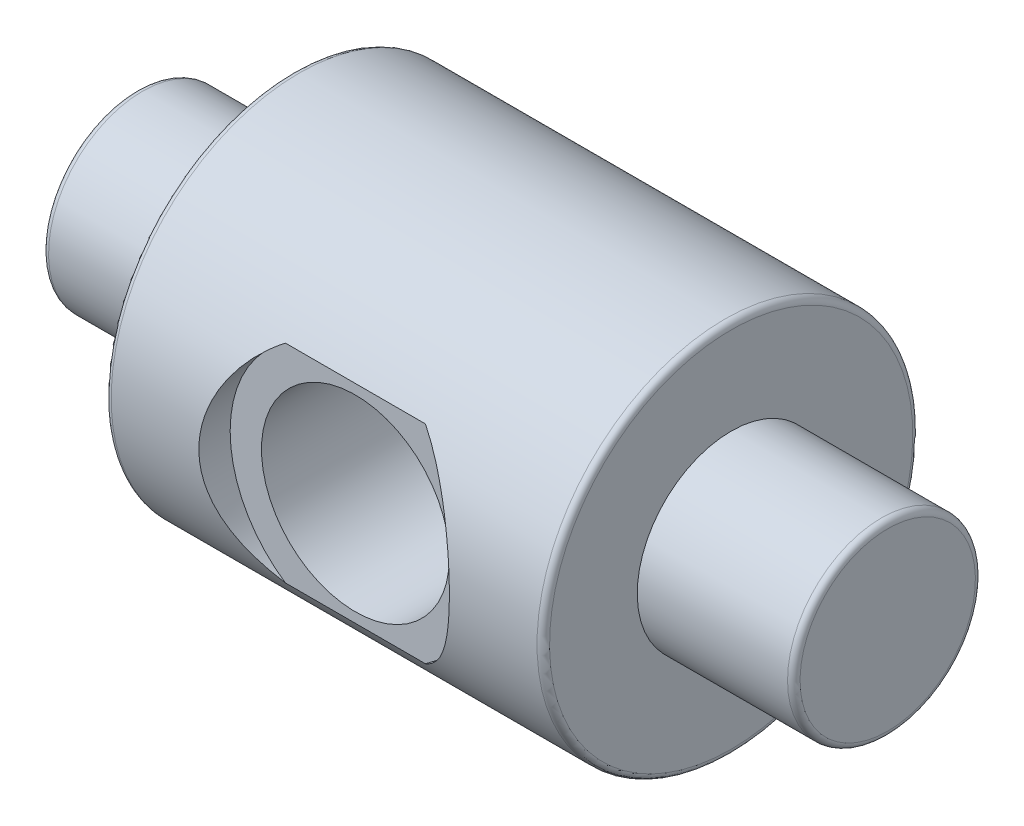
ISO-10303-21;
HEADER;
FILE_DESCRIPTION(('STEP AP214'),'2;1');
FILE_NAME('part.step','',(''),(''),'','','');
FILE_SCHEMA(('AUTOMOTIVE_DESIGN { 1 0 10303 214 1 1 1 1 }'));
ENDSEC;
DATA;
#1=APPLICATION_CONTEXT('core data for automotive mechanical design processes');
#2=APPLICATION_PROTOCOL_DEFINITION('international standard','automotive_design',2000,#1);
#3=PRODUCT_CONTEXT('',#1,'mechanical');
#4=PRODUCT('Part','Part','',(#3));
#5=PRODUCT_RELATED_PRODUCT_CATEGORY('part','',(#4));
#6=PRODUCT_DEFINITION_FORMATION('','',#4);
#7=PRODUCT_DEFINITION_CONTEXT('part definition',#1,'design');
#8=PRODUCT_DEFINITION('design','',#6,#7);
#9=PRODUCT_DEFINITION_SHAPE('','',#8);
#10=(LENGTH_UNIT() NAMED_UNIT(*) SI_UNIT(.MILLI.,.METRE.));
#11=(NAMED_UNIT(*) PLANE_ANGLE_UNIT() SI_UNIT($,.RADIAN.));
#12=(NAMED_UNIT(*) SI_UNIT($,.STERADIAN.) SOLID_ANGLE_UNIT());
#13=UNCERTAINTY_MEASURE_WITH_UNIT(LENGTH_MEASURE(1.E-05),#10,'distance_accuracy_value','');
#14=(GEOMETRIC_REPRESENTATION_CONTEXT(3) GLOBAL_UNCERTAINTY_ASSIGNED_CONTEXT((#13)) GLOBAL_UNIT_ASSIGNED_CONTEXT((#10,
#11,#12)) REPRESENTATION_CONTEXT('',''));
#15=CARTESIAN_POINT('',(0.,0.,0.));
#16=DIRECTION('',(0.,0.,1.));
#17=DIRECTION('',(1.,0.,0.));
#18=AXIS2_PLACEMENT_3D('',#15,#16,#17);
#19=CARTESIAN_POINT('',(7.94580419580419,-1.5,0.));
#20=DIRECTION('',(-1.,0.,0.));
#21=DIRECTION('',(0.,-1.,0.));
#22=AXIS2_PLACEMENT_3D('',#19,#20,#21);
#23=PLANE('',#22);
#24=CARTESIAN_POINT('',(7.94580419580419,0.,0.));
#25=DIRECTION('',(-1.,0.,0.));
#26=DIRECTION('',(0.,-1.,0.));
#27=AXIS2_PLACEMENT_3D('',#24,#25,#26);
#28=CIRCLE('',#27,1.4);
#29=CARTESIAN_POINT('',(7.94580419580419,-1.4,0.));
#30=VERTEX_POINT('',#29);
#31=EDGE_CURVE('E191',#30,#30,#28,.F.);
#32=ORIENTED_EDGE('',*,*,#31,.T.);
#33=EDGE_LOOP('',(#32));
#34=FACE_BOUND('',#33,.T.);
#35=ADVANCED_FACE('F41',(#34),#23,.F.);
#36=CARTESIAN_POINT('',(-4.05419580419581,0.,0.));
#37=DIRECTION('',(1.,0.,0.));
#38=DIRECTION('',(0.,1.,0.));
#39=AXIS2_PLACEMENT_3D('',#36,#37,#38);
#40=PLANE('',#39);
#41=CARTESIAN_POINT('',(-4.05419580419581,0.,0.));
#42=DIRECTION('',(1.,0.,0.));
#43=DIRECTION('',(0.,1.,0.));
#44=AXIS2_PLACEMENT_3D('',#41,#42,#43);
#45=CIRCLE('',#44,1.4);
#46=CARTESIAN_POINT('',(-4.05419580419581,1.4,0.));
#47=VERTEX_POINT('',#46);
#48=EDGE_CURVE('E88',#47,#47,#45,.F.);
#49=ORIENTED_EDGE('',*,*,#48,.T.);
#50=EDGE_LOOP('',(#49));
#51=FACE_BOUND('',#50,.T.);
#52=ADVANCED_FACE('F126',(#51),#40,.F.);
#53=CARTESIAN_POINT('',(7.94580419580419,0.,0.));
#54=DIRECTION('',(1.,0.,0.));
#55=DIRECTION('',(0.,1.,0.));
#56=AXIS2_PLACEMENT_3D('',#53,#54,#55);
#57=CYLINDRICAL_SURFACE('',#56,1.5);
#58=CARTESIAN_POINT('',(-3.95419580419581,0.,0.));
#59=DIRECTION('',(1.,0.,0.));
#60=DIRECTION('',(0.,1.,0.));
#61=AXIS2_PLACEMENT_3D('',#58,#59,#60);
#62=CIRCLE('',#61,1.5);
#63=CARTESIAN_POINT('',(-3.95419580419581,1.5,0.));
#64=VERTEX_POINT('',#63);
#65=EDGE_CURVE('E175',#64,#64,#62,.T.);
#66=ORIENTED_EDGE('',*,*,#65,.T.);
#67=EDGE_LOOP('',(#66));
#68=FACE_BOUND('',#67,.T.);
#69=CARTESIAN_POINT('',(-1.55419580419581,0.,0.));
#70=DIRECTION('',(1.,0.,0.));
#71=DIRECTION('',(0.,1.,0.));
#72=AXIS2_PLACEMENT_3D('',#69,#70,#71);
#73=CIRCLE('',#72,1.5);
#74=CARTESIAN_POINT('',(-1.55419580419581,1.5,0.));
#75=VERTEX_POINT('',#74);
#76=EDGE_CURVE('E188',#75,#75,#73,.T.);
#77=ORIENTED_EDGE('',*,*,#76,.F.);
#78=EDGE_LOOP('',(#77));
#79=FACE_BOUND('',#78,.T.);
#80=ADVANCED_FACE('F132',(#68,#79),#57,.T.);
#81=CARTESIAN_POINT('',(-1.55419580419581,-1.5,0.));
#82=DIRECTION('',(1.,0.,0.));
#83=DIRECTION('',(0.,1.,0.));
#84=AXIS2_PLACEMENT_3D('',#81,#82,#83);
#85=PLANE('',#84);
#86=CARTESIAN_POINT('',(-1.55419580419581,0.,0.));
#87=DIRECTION('',(1.,0.,0.));
#88=DIRECTION('',(0.,1.,0.));
#89=AXIS2_PLACEMENT_3D('',#86,#87,#88);
#90=CIRCLE('',#89,2.9);
#91=CARTESIAN_POINT('',(-1.55419580419581,2.9,0.));
#92=VERTEX_POINT('',#91);
#93=EDGE_CURVE('E154',#92,#92,#90,.F.);
#94=ORIENTED_EDGE('',*,*,#93,.T.);
#95=EDGE_LOOP('',(#94));
#96=FACE_BOUND('',#95,.T.);
#97=ORIENTED_EDGE('',*,*,#76,.T.);
#98=EDGE_LOOP('',(#97));
#99=FACE_BOUND('',#98,.T.);
#100=ADVANCED_FACE('F121',(#96,#99),#85,.F.);
#101=CARTESIAN_POINT('',(7.94580419580419,0.,0.));
#102=DIRECTION('',(1.,0.,0.));
#103=DIRECTION('',(0.,1.,0.));
#104=AXIS2_PLACEMENT_3D('',#101,#102,#103);
#105=CYLINDRICAL_SURFACE('',#104,3.);
#106=CARTESIAN_POINT('',(3.44580419580419,0.,-3.));
#107=CARTESIAN_POINT('',(3.44579924232841,-0.0788579444268502,-2.99999570107562));
#108=CARTESIAN_POINT('',(3.43954908612261,-0.157809899546344,-2.99685736529635));
#109=CARTESIAN_POINT('',(3.41482487529189,-0.313380352903344,-2.98461234055736));
#110=CARTESIAN_POINT('',(3.39632760630747,-0.389994130070444,-2.97549431743379));
#111=CARTESIAN_POINT('',(3.34801348287925,-0.538400317320674,-2.95224419105063));
#112=CARTESIAN_POINT('',(3.31824061943224,-0.61021020440872,-2.93813158766306));
#113=CARTESIAN_POINT('',(3.24844826375672,-0.747708925209898,-2.90618664773642));
#114=CARTESIAN_POINT('',(3.2084295794309,-0.813398240985089,-2.88835460450288));
#115=CARTESIAN_POINT('',(3.11652832157626,-0.941261726642864,-2.84934387387093));
#116=CARTESIAN_POINT('',(3.06407447694474,-1.00298281668316,-2.82802798691306));
#117=CARTESIAN_POINT('',(2.95002197693364,-1.11716916730047,-2.78489955370115));
#118=CARTESIAN_POINT('',(2.88841641814553,-1.16962737466015,-2.76308664313552));
#119=CARTESIAN_POINT('',(2.75207917151912,-1.26787800067542,-2.71948426796021));
#120=CARTESIAN_POINT('',(2.67670004828532,-1.31283800332746,-2.69782780455198));
#121=CARTESIAN_POINT('',(2.51825319182487,-1.38925234033604,-2.65928968158481));
#122=CARTESIAN_POINT('',(2.43519100272007,-1.4207163224495,-2.64240461410484));
#123=CARTESIAN_POINT('',(2.26880653767131,-1.46719866328288,-2.61686800556713));
#124=CARTESIAN_POINT('',(2.1857975177031,-1.48308878562066,-2.6077840737557));
#125=CARTESIAN_POINT('',(2.01783593913498,-1.50064048996327,-2.59772834922792));
#126=CARTESIAN_POINT('',(1.93288538449746,-1.50231613255961,-2.59674854014932));
#127=CARTESIAN_POINT('',(1.77437515933114,-1.49203093075844,-2.60266395385873));
#128=CARTESIAN_POINT('',(1.70066814896962,-1.48167683930523,-2.6086314549302));
#129=CARTESIAN_POINT('',(1.55622133174463,-1.4504097735854,-2.62614343100775));
#130=CARTESIAN_POINT('',(1.48548247784622,-1.42949343584648,-2.63768968247664));
#131=CARTESIAN_POINT('',(1.3469604969557,-1.37731467057901,-2.66531214619112));
#132=CARTESIAN_POINT('',(1.27928459762551,-1.34582260067399,-2.68148760995998));
#133=CARTESIAN_POINT('',(1.14985275691918,-1.273562531502,-2.71655106422106));
#134=CARTESIAN_POINT('',(1.08809949240406,-1.2327903657187,-2.73544027170286));
#135=CARTESIAN_POINT('',(0.964022316689354,-1.13709908236918,-2.77669736854929));
#136=CARTESIAN_POINT('',(0.902618885439958,-1.08104168755392,-2.79920265355119));
#137=CARTESIAN_POINT('',(0.789701067917841,-0.95933336811206,-2.84321434950611));
#138=CARTESIAN_POINT('',(0.738191407753369,-0.893677884861429,-2.86472027938201));
#139=CARTESIAN_POINT('',(0.644275704259602,-0.750774758747773,-2.90552980924446));
#140=CARTESIAN_POINT('',(0.602403487135583,-0.673130387399114,-2.92468476243011));
#141=CARTESIAN_POINT('',(0.53265865223968,-0.510699323233196,-2.95736821681863));
#142=CARTESIAN_POINT('',(0.504774918281444,-0.425918364397914,-2.9709011841533));
#143=CARTESIAN_POINT('',(0.466091090229179,-0.259149737491054,-2.98986500612153));
#144=CARTESIAN_POINT('',(0.454067342184021,-0.17751229582249,-2.99587407451965));
#145=CARTESIAN_POINT('',(0.443607099102462,-0.0131693999240281,-3.00109520188655));
#146=CARTESIAN_POINT('',(0.445164167344991,0.0695355298048624,-3.00031048081978));
#147=CARTESIAN_POINT('',(0.461114228432308,0.22684945797898,-2.99236788380152));
#148=CARTESIAN_POINT('',(0.474502994899184,0.301589112074894,-2.98570868532252));
#149=CARTESIAN_POINT('',(0.512161303646875,0.447610338452911,-2.9673325697226));
#150=CARTESIAN_POINT('',(0.536432045484434,0.51889152853663,-2.95561509501618));
#151=CARTESIAN_POINT('',(0.595801895453743,0.658332912674359,-2.92776377120382));
#152=CARTESIAN_POINT('',(0.631190770978624,0.726345595508705,-2.91151322654446));
#153=CARTESIAN_POINT('',(0.711465499274044,0.855692042548907,-2.87615961476126));
#154=CARTESIAN_POINT('',(0.756355397697286,0.917022944664887,-2.85705533350407));
#155=CARTESIAN_POINT('',(0.859444833800268,1.03765153393382,-2.81562332004297));
#156=CARTESIAN_POINT('',(0.918518498471914,1.09615811672854,-2.79316327265249));
#157=CARTESIAN_POINT('',(1.04569192272078,1.20278448167828,-2.7489358741323));
#158=CARTESIAN_POINT('',(1.11379787407607,1.25089707856781,-2.72716901100071));
#159=CARTESIAN_POINT('',(1.26126967706366,1.33756187171853,-2.68576788309734));
#160=CARTESIAN_POINT('',(1.34102109494591,1.37553824370037,-2.66628794383591));
#161=CARTESIAN_POINT('',(1.50706929716664,1.43712423890206,-2.63361108441202));
#162=CARTESIAN_POINT('',(1.59335748550453,1.46075237380052,-2.62040607332625));
#163=CARTESIAN_POINT('',(1.76116953013125,1.49079253120031,-2.60342251538703));
#164=CARTESIAN_POINT('',(1.84235557595706,1.49863949460818,-2.59886075197597));
#165=CARTESIAN_POINT('',(2.00497479655098,1.5010337315643,-2.59748031962405));
#166=CARTESIAN_POINT('',(2.08640784891099,1.49558676993486,-2.60065829439585));
#167=CARTESIAN_POINT('',(2.23902944810435,1.47288918838996,-2.61356793076615));
#168=CARTESIAN_POINT('',(2.3104549010213,1.45681247151455,-2.62264641723988));
#169=CARTESIAN_POINT('',(2.44951637494074,1.41476303733662,-2.64556524281479));
#170=CARTESIAN_POINT('',(2.51715116894224,1.38878713673988,-2.65940711354503));
#171=CARTESIAN_POINT('',(2.651741472284,1.32572361795085,-2.69142795546803));
#172=CARTESIAN_POINT('',(2.71834604854774,1.28800670672355,-2.70983583593881));
#173=CARTESIAN_POINT('',(2.84471600007608,1.20322645745609,-2.74852997452291));
#174=CARTESIAN_POINT('',(2.90447779158586,1.15615825686234,-2.76881720693416));
#175=CARTESIAN_POINT('',(3.02301716933621,1.04730498999206,-2.81193484737138));
#176=CARTESIAN_POINT('',(3.08079284932963,0.984426634495892,-2.83477474959942));
#177=CARTESIAN_POINT('',(3.1851986709571,0.849232209349796,-2.87816628389896));
#178=CARTESIAN_POINT('',(3.23182280500905,0.776911084957796,-2.89871667939293));
#179=CARTESIAN_POINT('',(3.3126587398723,0.623897395174419,-2.93547014349806));
#180=CARTESIAN_POINT('',(3.3467804496589,0.543149255665096,-2.95164144740899));
#181=CARTESIAN_POINT('',(3.40051644744031,0.37611315170713,-2.9775201194848));
#182=CARTESIAN_POINT('',(3.42017196601276,0.28984169938365,-2.98724585044602));
#183=CARTESIAN_POINT('',(3.43665031243281,0.168902919736343,-2.99543192870217));
#184=CARTESIAN_POINT('',(3.4400781571037,0.135242819162348,-2.99714048010376));
#185=CARTESIAN_POINT('',(3.44465619407532,0.0677275977076381,-2.99942545465223));
#186=CARTESIAN_POINT('',(3.44580632350951,0.033872471469943,-3.00000184655071));
#187=CARTESIAN_POINT('',(3.44580419580419,0.,-3.));
#188=B_SPLINE_CURVE_WITH_KNOTS('',3,(#106,#107,#108,#109,#110,#111,#112,#113,#114,#115,#116,
#117,#118,#119,#120,#121,#122,#123,#124,#125,#126,#127,#128,#129,#130,#131,#132,#133,#134,#135,
#136,#137,#138,#139,#140,#141,#142,#143,#144,#145,#146,#147,#148,#149,#150,#151,#152,#153,#154,
#155,#156,#157,#158,#159,#160,#161,#162,#163,#164,#165,#166,#167,#168,#169,#170,#171,#172,#173,
#174,#175,#176,#177,#178,#179,#180,#181,#182,#183,#184,#185,#186,#187),.UNSPECIFIED.,.T.,.F.,(4,
2,2,2,2,2,2,2,2,2,2,2,2,2,2,2,2,2,2,2,2,2,2,2,2,2,2,2,2,2,2,2,2,2,2,2,2,2,2,2,4),(0.,
0.236436386130439,0.473322224563797,0.709293233238448,0.945245640872352,1.19547263807713,
1.44588935648105,1.71572589646129,1.98536921847421,2.23887018210344,2.49212035993531,
2.71508568613981,2.93812205888518,3.16635360252731,3.39468781890333,3.65197412000818,
3.90938301898029,4.17874533321661,4.44789325368419,4.69474935707018,4.94148846767214,
5.16910359759183,5.39674382446397,5.63089284041848,5.86514176122509,6.12239415966628,
6.37982382923148,6.64972023242589,6.91926767918176,7.1629396125457,7.40650589797018,
7.62686895373284,7.84730293182527,8.08254685170431,8.31791341715446,8.58187864135757,
8.84598575071869,9.1119602049529,9.37717362931724,9.47872920200875,9.58028757766599),.UNSPECIFIED.);
#189=CARTESIAN_POINT('',(3.44580419580419,0.,-3.));
#190=VERTEX_POINT('',#189);
#191=EDGE_CURVE('E213',#190,#190,#188,.T.);
#192=ORIENTED_EDGE('',*,*,#191,.F.);
#193=EDGE_LOOP('',(#192));
#194=FACE_BOUND('',#193,.T.);
#195=DIRECTION('',(1.,0.,0.));
#196=VECTOR('',#195,1.);
#197=CARTESIAN_POINT('',(7.94580419580419,-1.6583123951777,2.5));
#198=LINE('',#197,#196);
#199=CARTESIAN_POINT('',(0.827770207054297,-1.6583123951777,2.5));
#200=VERTEX_POINT('',#199);
#201=CARTESIAN_POINT('',(3.06383818455409,-1.6583123951777,2.5));
#202=VERTEX_POINT('',#201);
#203=EDGE_CURVE('E11',#200,#202,#198,.T.);
#204=ORIENTED_EDGE('',*,*,#203,.F.);
#205=CARTESIAN_POINT('',(0.827770207054297,-1.6583123951777,2.5));
#206=CARTESIAN_POINT('',(0.779685945316833,-1.62588041682893,2.52151479876285));
#207=CARTESIAN_POINT('',(0.733152584594997,-1.59147775995563,2.54342347636609));
#208=CARTESIAN_POINT('',(0.643288747881532,-1.51881718972826,2.5874697531549));
#209=CARTESIAN_POINT('',(0.599959256821425,-1.48055809930372,2.60960742037181));
#210=CARTESIAN_POINT('',(0.474370998134739,-1.35957897250648,2.67582114663101));
#211=CARTESIAN_POINT('',(0.397208935398831,-1.27112677213643,2.71937159504119));
#212=CARTESIAN_POINT('',(0.258333778056647,-1.0800174283792,2.80078430015006));
#213=CARTESIAN_POINT('',(0.196668052805781,-0.977318184431939,2.83862897767655));
#214=CARTESIAN_POINT('',(0.0920064420860454,-0.760170773384892,2.90429124381123));
#215=CARTESIAN_POINT('',(0.0489438146591888,-0.645766459364152,2.93214461594087));
#216=CARTESIAN_POINT('',(-0.0120857428518818,-0.422457298896366,2.97201413865436));
#217=CARTESIAN_POINT('',(-0.0323857129055941,-0.314455876194931,2.98549347454722));
#218=CARTESIAN_POINT('',(-0.0549185653556693,-0.0957318708440023,3.00046894125686));
#219=CARTESIAN_POINT('',(-0.0571581058479313,0.0149896939065711,3.00196948813078));
#220=CARTESIAN_POINT('',(-0.0443642776334021,0.219788899237262,2.99345292695804));
#221=CARTESIAN_POINT('',(-0.0316315152469733,0.314087916632495,2.98496974119453));
#222=CARTESIAN_POINT('',(0.0067156534721659,0.498831374402186,2.95970537418975));
#223=CARTESIAN_POINT('',(0.0323281037416411,0.589276397828328,2.94292545299631));
#224=CARTESIAN_POINT('',(0.0958871927934474,0.766037685544142,2.90199776264025));
#225=CARTESIAN_POINT('',(0.134070351168904,0.852235141290292,2.87770930064207));
#226=CARTESIAN_POINT('',(0.221244871959259,1.01715798189846,2.8236387306717));
#227=CARTESIAN_POINT('',(0.270247158057769,1.09587569901239,2.79385107537833));
#228=CARTESIAN_POINT('',(0.385548338380811,1.25565427239455,2.72615287516341));
#229=CARTESIAN_POINT('',(0.453323179510542,1.33541158103129,2.6876905104863));
#230=CARTESIAN_POINT('',(0.599836191729014,1.48295801527083,2.60917581519461));
#231=CARTESIAN_POINT('',(0.67855685828405,1.55076586541565,2.56912609477701));
#232=CARTESIAN_POINT('',(0.783762675861827,1.62799531219029,2.51991822969558));
#233=CARTESIAN_POINT('',(0.805606913338656,1.64336841165434,2.5099145043454));
#234=CARTESIAN_POINT('',(0.827770207054296,1.6583123951777,2.5));
#235=B_SPLINE_CURVE_WITH_KNOTS('',3,(#205,#206,#207,#208,#209,#210,#211,#212,#213,#214,#215,
#216,#217,#218,#219,#220,#221,#222,#223,#224,#225,#226,#227,#228,#229,#230,#231,#232,#233,#234),
.UNSPECIFIED.,.F.,.F.,(4,2,2,2,2,2,2,2,2,2,2,2,2,2,4),(0.,0.185463815245249,0.370984410633051,
0.744697847347587,1.1195401269487,1.49302619268151,1.82315350216072,2.1531591024743,
2.43842427846838,2.72364614376402,3.01457448418865,3.30579791879389,3.6390815214847,
3.97183814013364,4.05738621739483),.UNSPECIFIED.);
#236=CARTESIAN_POINT('',(0.827770207054297,1.6583123951777,2.5));
#237=VERTEX_POINT('',#236);
#238=EDGE_CURVE('E75',#200,#237,#235,.T.);
#239=ORIENTED_EDGE('',*,*,#238,.T.);
#240=DIRECTION('',(1.,0.,0.));
#241=VECTOR('',#240,1.);
#242=CARTESIAN_POINT('',(7.94580419580419,1.6583123951777,2.5));
#243=LINE('',#242,#241);
#244=CARTESIAN_POINT('',(3.06383818455409,1.6583123951777,2.5));
#245=VERTEX_POINT('',#244);
#246=EDGE_CURVE('E50',#245,#237,#243,.F.);
#247=ORIENTED_EDGE('',*,*,#246,.F.);
#248=CARTESIAN_POINT('',(3.06383818455409,1.6583123951777,2.5));
#249=CARTESIAN_POINT('',(3.11191178235131,1.6258873642231,2.52151001312796));
#250=CARTESIAN_POINT('',(3.15843510549844,1.59149294579639,2.54341372114114));
#251=CARTESIAN_POINT('',(3.24828089960978,1.51885007427147,2.58745036830228));
#252=CARTESIAN_POINT('',(3.29160234535144,1.48060039592844,2.60958337830715));
#253=CARTESIAN_POINT('',(3.41720432832784,1.35961640589293,2.67580244791161));
#254=CARTESIAN_POINT('',(3.49438486707682,1.27114452414492,2.71936294341682));
#255=CARTESIAN_POINT('',(3.63330567783501,1.07997701210369,2.80080261031528));
#256=CARTESIAN_POINT('',(3.69499483340098,0.977235986077269,2.83866281226665));
#257=CARTESIAN_POINT('',(3.79964233627908,0.760056300306222,2.90431693687234));
#258=CARTESIAN_POINT('',(3.84268402034553,0.645672566937875,2.93215555020667));
#259=CARTESIAN_POINT('',(3.89828577989016,0.442262965807034,2.96848222513164));
#260=CARTESIAN_POINT('',(3.91602259651958,0.355206388867216,2.98021552307509));
#261=CARTESIAN_POINT('',(3.93978389025567,0.178772504833101,2.99597611850312));
#262=CARTESIAN_POINT('',(3.94580628592278,0.0893947881728608,3.00000204652624));
#263=CARTESIAN_POINT('',(3.94580184662937,-0.100474675054874,2.9999976998205));
#264=CARTESIAN_POINT('',(3.93818907429411,-0.200970915673955,2.99490706648021));
#265=CARTESIAN_POINT('',(3.90820691112413,-0.398741600010064,2.97504644392662));
#266=CARTESIAN_POINT('',(3.88583128517415,-0.496014664174523,2.96027236491161));
#267=CARTESIAN_POINT('',(3.82770515128703,-0.684182849018027,2.92251047554535));
#268=CARTESIAN_POINT('',(3.7920210054226,-0.775107000935844,2.89956344422965));
#269=CARTESIAN_POINT('',(3.70876937362634,-0.949365498586441,2.84727869888586));
#270=CARTESIAN_POINT('',(3.6611929941124,-1.03269410006907,2.81793620413586));
#271=CARTESIAN_POINT('',(3.55107512941529,-1.19739254671204,2.75223145355421));
#272=CARTESIAN_POINT('',(3.4875990520034,-1.2779789171133,2.71548267020019));
#273=CARTESIAN_POINT('',(3.34987715029411,-1.42791517388998,2.63971454495952));
#274=CARTESIAN_POINT('',(3.27564348652293,-1.49727756307281,2.60069779624674));
#275=CARTESIAN_POINT('',(3.1536939004277,-1.59499101398225,2.54118872231492));
#276=CARTESIAN_POINT('',(3.10944255257411,-1.62755479088594,2.52041236005112));
#277=CARTESIAN_POINT('',(3.06383818455437,-1.65831239517809,2.50000000000007));
#278=B_SPLINE_CURVE_WITH_KNOTS('',3,(#248,#249,#250,#251,#252,#253,#254,#255,#256,#257,#258,
#259,#260,#261,#262,#263,#264,#265,#266,#267,#268,#269,#270,#271,#272,#273,#274,#275,#276,#277),
.UNSPECIFIED.,.F.,.F.,(4,2,2,2,2,2,2,2,2,2,2,2,2,2,4),(0.,0.18542255262513,0.370904221550316,
0.744697636055784,1.11970870108441,1.49302608142482,1.76083995125021,2.02870140238451,
2.32976249120777,2.63095081513879,2.93065693760602,3.23058786878475,3.55628934735127,
3.88162547955982,4.05765893947298),.UNSPECIFIED.);
#279=EDGE_CURVE('E56',#245,#202,#278,.T.);
#280=ORIENTED_EDGE('',*,*,#279,.T.);
#281=EDGE_LOOP('',(#204,#239,#247,#280));
#282=FACE_BOUND('',#281,.T.);
#283=CARTESIAN_POINT('',(5.34580419580419,0.,0.));
#284=DIRECTION('',(-1.,0.,0.));
#285=DIRECTION('',(0.,-1.,0.));
#286=AXIS2_PLACEMENT_3D('',#283,#284,#285);
#287=CIRCLE('',#286,3.);
#288=CARTESIAN_POINT('',(5.34580419580419,-3.,0.));
#289=VERTEX_POINT('',#288);
#290=EDGE_CURVE('E160',#289,#289,#287,.T.);
#291=ORIENTED_EDGE('',*,*,#290,.T.);
#292=EDGE_LOOP('',(#291));
#293=FACE_BOUND('',#292,.T.);
#294=CARTESIAN_POINT('',(-1.45419580419581,0.,0.));
#295=DIRECTION('',(1.,0.,0.));
#296=DIRECTION('',(0.,1.,0.));
#297=AXIS2_PLACEMENT_3D('',#294,#295,#296);
#298=CIRCLE('',#297,3.);
#299=CARTESIAN_POINT('',(-1.45419580419581,3.,0.));
#300=VERTEX_POINT('',#299);
#301=EDGE_CURVE('E157',#300,#300,#298,.T.);
#302=ORIENTED_EDGE('',*,*,#301,.T.);
#303=EDGE_LOOP('',(#302));
#304=FACE_BOUND('',#303,.T.);
#305=ADVANCED_FACE('F81',(#194,#282,#293,#304),#105,.T.);
#306=CARTESIAN_POINT('',(5.44580419580419,-3.,0.));
#307=DIRECTION('',(-1.,0.,0.));
#308=DIRECTION('',(0.,-1.,0.));
#309=AXIS2_PLACEMENT_3D('',#306,#307,#308);
#310=PLANE('',#309);
#311=CARTESIAN_POINT('',(5.44580419580419,0.,0.));
#312=DIRECTION('',(-1.,0.,0.));
#313=DIRECTION('',(0.,-1.,0.));
#314=AXIS2_PLACEMENT_3D('',#311,#312,#313);
#315=CIRCLE('',#314,2.9);
#316=CARTESIAN_POINT('',(5.44580419580419,-2.9,0.));
#317=VERTEX_POINT('',#316);
#318=EDGE_CURVE('E161',#317,#317,#315,.F.);
#319=ORIENTED_EDGE('',*,*,#318,.T.);
#320=EDGE_LOOP('',(#319));
#321=FACE_BOUND('',#320,.T.);
#322=CARTESIAN_POINT('',(5.44580419580419,0.,0.));
#323=DIRECTION('',(1.,0.,0.));
#324=DIRECTION('',(0.,1.,0.));
#325=AXIS2_PLACEMENT_3D('',#322,#323,#324);
#326=CIRCLE('',#325,1.5);
#327=CARTESIAN_POINT('',(5.44580419580419,1.5,0.));
#328=VERTEX_POINT('',#327);
#329=EDGE_CURVE('E79',#328,#328,#326,.T.);
#330=ORIENTED_EDGE('',*,*,#329,.F.);
#331=EDGE_LOOP('',(#330));
#332=FACE_BOUND('',#331,.T.);
#333=ADVANCED_FACE('F114',(#321,#332),#310,.F.);
#334=CARTESIAN_POINT('',(7.94580419580419,0.,0.));
#335=DIRECTION('',(1.,0.,0.));
#336=DIRECTION('',(0.,1.,0.));
#337=AXIS2_PLACEMENT_3D('',#334,#335,#336);
#338=CYLINDRICAL_SURFACE('',#337,1.5);
#339=CARTESIAN_POINT('',(7.8458041958042,0.,0.));
#340=DIRECTION('',(-1.,0.,0.));
#341=DIRECTION('',(0.,-1.,0.));
#342=AXIS2_PLACEMENT_3D('',#339,#340,#341);
#343=CIRCLE('',#342,1.5);
#344=CARTESIAN_POINT('',(7.8458041958042,-1.5,0.));
#345=VERTEX_POINT('',#344);
#346=EDGE_CURVE('E170',#345,#345,#343,.T.);
#347=ORIENTED_EDGE('',*,*,#346,.T.);
#348=EDGE_LOOP('',(#347));
#349=FACE_BOUND('',#348,.T.);
#350=ORIENTED_EDGE('',*,*,#329,.T.);
#351=EDGE_LOOP('',(#350));
#352=FACE_BOUND('',#351,.T.);
#353=ADVANCED_FACE('F110',(#349,#352),#338,.T.);
#354=CARTESIAN_POINT('',(7.8458041958042,0.,0.));
#355=DIRECTION('',(-1.,0.,0.));
#356=DIRECTION('',(0.,-1.,0.));
#357=AXIS2_PLACEMENT_3D('',#354,#355,#356);
#358=TOROIDAL_SURFACE('',#357,1.4,0.1);
#359=ORIENTED_EDGE('',*,*,#346,.F.);
#360=EDGE_LOOP('',(#359));
#361=FACE_BOUND('',#360,.T.);
#362=ORIENTED_EDGE('',*,*,#31,.F.);
#363=EDGE_LOOP('',(#362));
#364=FACE_BOUND('',#363,.T.);
#365=ADVANCED_FACE('F113',(#361,#364),#358,.T.);
#366=CARTESIAN_POINT('',(5.34580419580419,0.,0.));
#367=DIRECTION('',(-1.,0.,0.));
#368=DIRECTION('',(0.,-1.,0.));
#369=AXIS2_PLACEMENT_3D('',#366,#367,#368);
#370=TOROIDAL_SURFACE('',#369,2.9,0.1);
#371=ORIENTED_EDGE('',*,*,#290,.F.);
#372=EDGE_LOOP('',(#371));
#373=FACE_BOUND('',#372,.T.);
#374=ORIENTED_EDGE('',*,*,#318,.F.);
#375=EDGE_LOOP('',(#374));
#376=FACE_BOUND('',#375,.T.);
#377=ADVANCED_FACE('F140',(#373,#376),#370,.T.);
#378=CARTESIAN_POINT('',(-1.45419580419581,0.,0.));
#379=DIRECTION('',(1.,0.,0.));
#380=DIRECTION('',(0.,1.,0.));
#381=AXIS2_PLACEMENT_3D('',#378,#379,#380);
#382=TOROIDAL_SURFACE('',#381,2.9,0.1);
#383=ORIENTED_EDGE('',*,*,#93,.F.);
#384=EDGE_LOOP('',(#383));
#385=FACE_BOUND('',#384,.T.);
#386=ORIENTED_EDGE('',*,*,#301,.F.);
#387=EDGE_LOOP('',(#386));
#388=FACE_BOUND('',#387,.T.);
#389=ADVANCED_FACE('F143',(#385,#388),#382,.T.);
#390=CARTESIAN_POINT('',(-3.95419580419581,0.,0.));
#391=DIRECTION('',(1.,0.,0.));
#392=DIRECTION('',(0.,1.,0.));
#393=AXIS2_PLACEMENT_3D('',#390,#391,#392);
#394=TOROIDAL_SURFACE('',#393,1.4,0.1);
#395=ORIENTED_EDGE('',*,*,#48,.F.);
#396=EDGE_LOOP('',(#395));
#397=FACE_BOUND('',#396,.T.);
#398=ORIENTED_EDGE('',*,*,#65,.F.);
#399=EDGE_LOOP('',(#398));
#400=FACE_BOUND('',#399,.T.);
#401=ADVANCED_FACE('F43',(#397,#400),#394,.T.);
#402=CARTESIAN_POINT('',(1.94580419580419,0.,2.5));
#403=DIRECTION('',(0.,0.,1.));
#404=DIRECTION('',(1.,0.,0.));
#405=AXIS2_PLACEMENT_3D('',#402,#403,#404);
#406=CYLINDRICAL_SURFACE('',#405,2.);
#407=CARTESIAN_POINT('',(1.94580419580419,0.,2.5));
#408=DIRECTION('',(0.,0.,1.));
#409=DIRECTION('',(1.,0.,0.));
#410=AXIS2_PLACEMENT_3D('',#407,#408,#409);
#411=CIRCLE('',#410,2.);
#412=EDGE_CURVE('E70',#237,#200,#411,.T.);
#413=ORIENTED_EDGE('',*,*,#412,.F.);
#414=ORIENTED_EDGE('',*,*,#238,.F.);
#415=EDGE_LOOP('',(#413,#414));
#416=FACE_BOUND('',#415,.T.);
#417=ADVANCED_FACE('F77',(#416),#406,.F.);
#418=EDGE_CURVE('E71',#202,#245,#411,.T.);
#419=ORIENTED_EDGE('',*,*,#418,.F.);
#420=ORIENTED_EDGE('',*,*,#279,.F.);
#421=EDGE_LOOP('',(#419,#420));
#422=FACE_BOUND('',#421,.T.);
#423=ADVANCED_FACE('F108',(#422),#406,.F.);
#424=CARTESIAN_POINT('',(1.94580419580419,0.,2.5));
#425=DIRECTION('',(0.,0.,1.));
#426=DIRECTION('',(1.,0.,0.));
#427=AXIS2_PLACEMENT_3D('',#424,#425,#426);
#428=PLANE('',#427);
#429=CARTESIAN_POINT('',(1.94580419580419,0.,2.5));
#430=DIRECTION('',(0.,0.,1.));
#431=DIRECTION('',(1.,0.,0.));
#432=AXIS2_PLACEMENT_3D('',#429,#430,#431);
#433=CIRCLE('',#432,1.5);
#434=CARTESIAN_POINT('',(3.44580419580419,0.,2.5));
#435=VERTEX_POINT('',#434);
#436=EDGE_CURVE('E221',#435,#435,#433,.T.);
#437=ORIENTED_EDGE('',*,*,#436,.F.);
#438=EDGE_LOOP('',(#437));
#439=FACE_BOUND('',#438,.T.);
#440=ORIENTED_EDGE('',*,*,#203,.T.);
#441=ORIENTED_EDGE('',*,*,#418,.T.);
#442=ORIENTED_EDGE('',*,*,#246,.T.);
#443=ORIENTED_EDGE('',*,*,#412,.T.);
#444=EDGE_LOOP('',(#440,#441,#442,#443));
#445=FACE_BOUND('',#444,.T.);
#446=ADVANCED_FACE('F69',(#439,#445),#428,.T.);
#447=CARTESIAN_POINT('',(1.94580419580419,0.,-3.001));
#448=DIRECTION('',(0.,0.,1.));
#449=DIRECTION('',(1.,0.,0.));
#450=AXIS2_PLACEMENT_3D('',#447,#448,#449);
#451=CYLINDRICAL_SURFACE('',#450,1.5);
#452=ORIENTED_EDGE('',*,*,#436,.T.);
#453=EDGE_LOOP('',(#452));
#454=FACE_BOUND('',#453,.T.);
#455=ORIENTED_EDGE('',*,*,#191,.T.);
#456=EDGE_LOOP('',(#455));
#457=FACE_BOUND('',#456,.T.);
#458=ADVANCED_FACE('F222',(#454,#457),#451,.F.);
#459=CLOSED_SHELL('',(#35,#52,#80,#100,#305,#333,#353,#365,#377,#389,#401,#417,#423,#446,#458));
#460=MANIFOLD_SOLID_BREP('B2',#459);
#461=ADVANCED_BREP_SHAPE_REPRESENTATION('',(#18,#460),#14);
#462=SHAPE_DEFINITION_REPRESENTATION(#9,#461);
ENDSEC;
END-ISO-10303-21;
